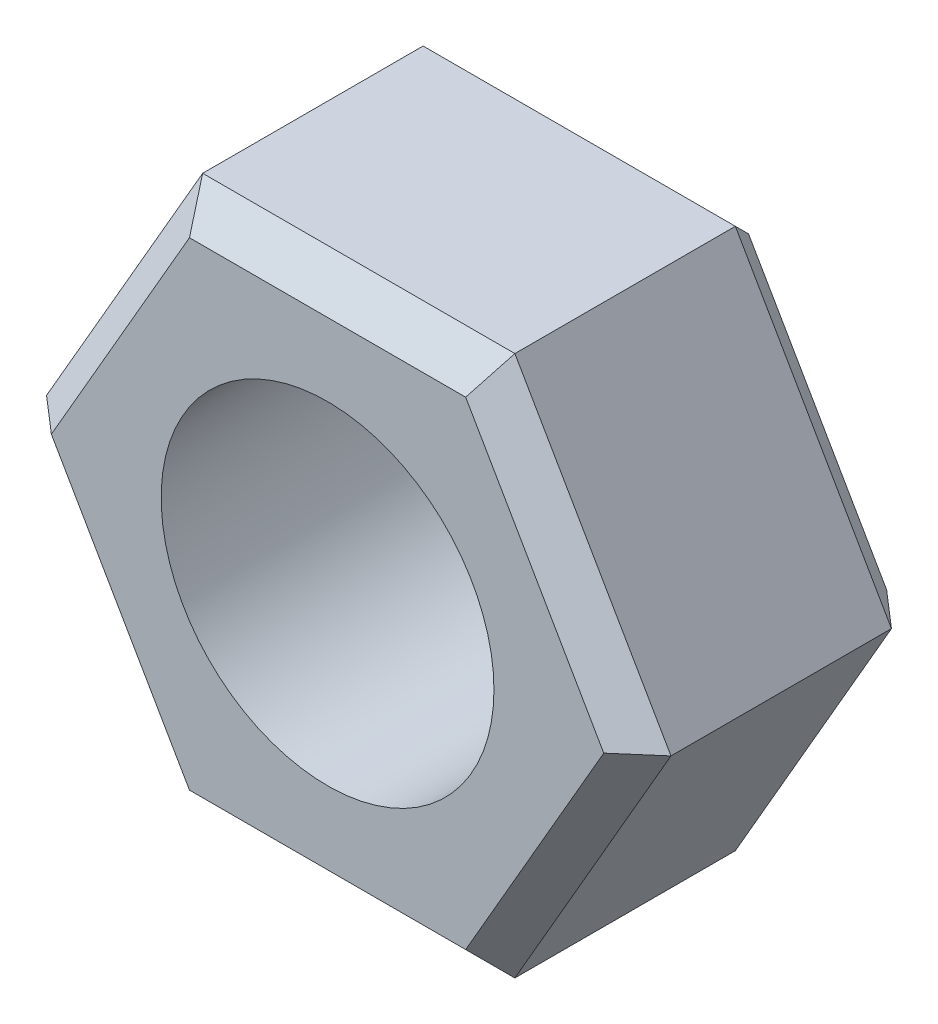
ISO-10303-21;
HEADER;
FILE_DESCRIPTION(('STEP AP214'),'2;1');
FILE_NAME('part.step','',(''),(''),'','','');
FILE_SCHEMA(('AUTOMOTIVE_DESIGN { 1 0 10303 214 1 1 1 1 }'));
ENDSEC;
DATA;
#1=APPLICATION_CONTEXT('core data for automotive mechanical design processes');
#2=APPLICATION_PROTOCOL_DEFINITION('international standard','automotive_design',2000,#1);
#3=PRODUCT_CONTEXT('',#1,'mechanical');
#4=PRODUCT('Part','Part','',(#3));
#5=PRODUCT_RELATED_PRODUCT_CATEGORY('part','',(#4));
#6=PRODUCT_DEFINITION_FORMATION('','',#4);
#7=PRODUCT_DEFINITION_CONTEXT('part definition',#1,'design');
#8=PRODUCT_DEFINITION('design','',#6,#7);
#9=PRODUCT_DEFINITION_SHAPE('','',#8);
#10=(LENGTH_UNIT() NAMED_UNIT(*) SI_UNIT(.MILLI.,.METRE.));
#11=(NAMED_UNIT(*) PLANE_ANGLE_UNIT() SI_UNIT($,.RADIAN.));
#12=(NAMED_UNIT(*) SI_UNIT($,.STERADIAN.) SOLID_ANGLE_UNIT());
#13=UNCERTAINTY_MEASURE_WITH_UNIT(LENGTH_MEASURE(1.E-05),#10,'distance_accuracy_value','');
#14=(GEOMETRIC_REPRESENTATION_CONTEXT(3) GLOBAL_UNCERTAINTY_ASSIGNED_CONTEXT((#13)) GLOBAL_UNIT_ASSIGNED_CONTEXT((#10,
#11,#12)) REPRESENTATION_CONTEXT('',''));
#15=CARTESIAN_POINT('',(0.,0.,0.));
#16=DIRECTION('',(0.,0.,1.));
#17=DIRECTION('',(1.,0.,0.));
#18=AXIS2_PLACEMENT_3D('',#15,#16,#17);
#19=CARTESIAN_POINT('',(0.,0.,6.8));
#20=DIRECTION('',(0.,0.,1.));
#21=DIRECTION('',(1.,0.,0.));
#22=AXIS2_PLACEMENT_3D('',#19,#20,#21);
#23=PLANE('',#22);
#24=DIRECTION('',(-0.5,-0.866025403784439,0.));
#25=VECTOR('',#24,1.);
#26=CARTESIAN_POINT('',(-6.8560344466268,-0.375000000000003,6.8));
#27=LINE('',#26,#25);
#28=CARTESIAN_POINT('',(-3.31976404784035,5.75,6.8));
#29=VERTEX_POINT('',#28);
#30=CARTESIAN_POINT('',(-6.63952809568069,0.,6.8));
#31=VERTEX_POINT('',#30);
#32=EDGE_CURVE('E151',#29,#31,#27,.T.);
#33=ORIENTED_EDGE('',*,*,#32,.T.);
#34=DIRECTION('',(0.5,-0.866025403784439,0.));
#35=VECTOR('',#34,1.);
#36=CARTESIAN_POINT('',(-3.10325769689423,-6.125,6.8));
#37=LINE('',#36,#35);
#38=CARTESIAN_POINT('',(-3.31976404784034,-5.75,6.8));
#39=VERTEX_POINT('',#38);
#40=EDGE_CURVE('E132',#31,#39,#37,.T.);
#41=ORIENTED_EDGE('',*,*,#40,.T.);
#42=DIRECTION('',(1.,0.,0.));
#43=VECTOR('',#42,1.);
#44=CARTESIAN_POINT('',(3.75277674973257,-5.75,6.8));
#45=LINE('',#44,#43);
#46=CARTESIAN_POINT('',(3.31976404784035,-5.75,6.8));
#47=VERTEX_POINT('',#46);
#48=EDGE_CURVE('E140',#39,#47,#45,.T.);
#49=ORIENTED_EDGE('',*,*,#48,.T.);
#50=DIRECTION('',(0.5,0.866025403784439,0.));
#51=VECTOR('',#50,1.);
#52=CARTESIAN_POINT('',(6.8560344466268,0.375000000000004,6.8));
#53=LINE('',#52,#51);
#54=CARTESIAN_POINT('',(6.63952809568069,0.,6.8));
#55=VERTEX_POINT('',#54);
#56=EDGE_CURVE('E146',#47,#55,#53,.T.);
#57=ORIENTED_EDGE('',*,*,#56,.T.);
#58=DIRECTION('',(-0.5,0.866025403784439,0.));
#59=VECTOR('',#58,1.);
#60=CARTESIAN_POINT('',(3.10325769689424,6.125,6.8));
#61=LINE('',#60,#59);
#62=CARTESIAN_POINT('',(3.31976404784035,5.75,6.8));
#63=VERTEX_POINT('',#62);
#64=EDGE_CURVE('E264',#55,#63,#61,.T.);
#65=ORIENTED_EDGE('',*,*,#64,.T.);
#66=DIRECTION('',(-1.,0.,0.));
#67=VECTOR('',#66,1.);
#68=CARTESIAN_POINT('',(-3.75277674973257,5.75,6.8));
#69=LINE('',#68,#67);
#70=EDGE_CURVE('E156',#63,#29,#69,.T.);
#71=ORIENTED_EDGE('',*,*,#70,.T.);
#72=EDGE_LOOP('',(#33,#41,#49,#57,#65,#71));
#73=FACE_BOUND('',#72,.T.);
#74=CARTESIAN_POINT('',(0.,0.,6.8));
#75=DIRECTION('',(0.,0.,1.));
#76=DIRECTION('',(1.,0.,0.));
#77=AXIS2_PLACEMENT_3D('',#74,#75,#76);
#78=CIRCLE('',#77,4.);
#79=CARTESIAN_POINT('',(4.,0.,6.8));
#80=VERTEX_POINT('',#79);
#81=EDGE_CURVE('E246',#80,#80,#78,.T.);
#82=ORIENTED_EDGE('',*,*,#81,.F.);
#83=EDGE_LOOP('',(#82));
#84=FACE_BOUND('',#83,.T.);
#85=ADVANCED_FACE('F37',(#73,#84),#23,.T.);
#86=CARTESIAN_POINT('',(0.,0.,0.));
#87=DIRECTION('',(0.,0.,1.));
#88=DIRECTION('',(1.,0.,0.));
#89=AXIS2_PLACEMENT_3D('',#86,#87,#88);
#90=PLANE('',#89);
#91=DIRECTION('',(-0.5,-0.866025403784439,0.));
#92=VECTOR('',#91,1.);
#93=CARTESIAN_POINT('',(4.97964607176052,-2.875,0.));
#94=LINE('',#93,#92);
#95=CARTESIAN_POINT('',(6.63952809568069,0.,0.));
#96=VERTEX_POINT('',#95);
#97=CARTESIAN_POINT('',(3.31976404784035,-5.75,0.));
#98=VERTEX_POINT('',#97);
#99=EDGE_CURVE('E47',#96,#98,#94,.T.);
#100=ORIENTED_EDGE('',*,*,#99,.T.);
#101=DIRECTION('',(-1.,0.,0.));
#102=VECTOR('',#101,1.);
#103=CARTESIAN_POINT('',(0.,-5.75,0.));
#104=LINE('',#103,#102);
#105=CARTESIAN_POINT('',(-3.31976404784034,-5.75,0.));
#106=VERTEX_POINT('',#105);
#107=EDGE_CURVE('E11',#98,#106,#104,.T.);
#108=ORIENTED_EDGE('',*,*,#107,.T.);
#109=DIRECTION('',(-0.5,0.866025403784439,0.));
#110=VECTOR('',#109,1.);
#111=CARTESIAN_POINT('',(-4.97964607176052,-2.875,0.));
#112=LINE('',#111,#110);
#113=CARTESIAN_POINT('',(-6.63952809568069,0.,0.));
#114=VERTEX_POINT('',#113);
#115=EDGE_CURVE('E182',#106,#114,#112,.T.);
#116=ORIENTED_EDGE('',*,*,#115,.T.);
#117=DIRECTION('',(0.5,0.866025403784439,0.));
#118=VECTOR('',#117,1.);
#119=CARTESIAN_POINT('',(-4.97964607176052,2.875,0.));
#120=LINE('',#119,#118);
#121=CARTESIAN_POINT('',(-3.31976404784035,5.74999999999999,0.));
#122=VERTEX_POINT('',#121);
#123=EDGE_CURVE('E184',#114,#122,#120,.T.);
#124=ORIENTED_EDGE('',*,*,#123,.T.);
#125=DIRECTION('',(1.,0.,0.));
#126=VECTOR('',#125,1.);
#127=CARTESIAN_POINT('',(0.,5.74999999999999,0.));
#128=LINE('',#127,#126);
#129=CARTESIAN_POINT('',(3.31976404784035,5.74999999999999,0.));
#130=VERTEX_POINT('',#129);
#131=EDGE_CURVE('E186',#122,#130,#128,.T.);
#132=ORIENTED_EDGE('',*,*,#131,.T.);
#133=DIRECTION('',(0.5,-0.866025403784439,0.));
#134=VECTOR('',#133,1.);
#135=CARTESIAN_POINT('',(4.97964607176052,2.875,0.));
#136=LINE('',#135,#134);
#137=EDGE_CURVE('E58',#130,#96,#136,.T.);
#138=ORIENTED_EDGE('',*,*,#137,.T.);
#139=EDGE_LOOP('',(#100,#108,#116,#124,#132,#138));
#140=FACE_BOUND('',#139,.T.);
#141=CARTESIAN_POINT('',(0.,0.,0.));
#142=DIRECTION('',(0.,0.,1.));
#143=DIRECTION('',(1.,0.,0.));
#144=AXIS2_PLACEMENT_3D('',#141,#142,#143);
#145=CIRCLE('',#144,4.);
#146=CARTESIAN_POINT('',(4.,0.,0.));
#147=VERTEX_POINT('',#146);
#148=EDGE_CURVE('E201',#147,#147,#145,.T.);
#149=ORIENTED_EDGE('',*,*,#148,.T.);
#150=EDGE_LOOP('',(#149));
#151=FACE_BOUND('',#150,.T.);
#152=ADVANCED_FACE('F226',(#140,#151),#90,.F.);
#153=CARTESIAN_POINT('',(-3.75277674973257,-6.5,6.8));
#154=DIRECTION('',(0.,1.,0.));
#155=DIRECTION('',(-1.,0.,0.));
#156=AXIS2_PLACEMENT_3D('',#153,#154,#155);
#157=PLANE('',#156);
#158=DIRECTION('',(0.,0.,-1.));
#159=VECTOR('',#158,1.);
#160=CARTESIAN_POINT('',(3.75277674973257,-6.5,6.8));
#161=LINE('',#160,#159);
#162=CARTESIAN_POINT('',(3.75277674973257,-6.5,6.05));
#163=VERTEX_POINT('',#162);
#164=CARTESIAN_POINT('',(3.75277674973257,-6.5,0.750000000000002));
#165=VERTEX_POINT('',#164);
#166=EDGE_CURVE('E147',#163,#165,#161,.T.);
#167=ORIENTED_EDGE('',*,*,#166,.F.);
#168=DIRECTION('',(-1.,0.,0.));
#169=VECTOR('',#168,1.);
#170=CARTESIAN_POINT('',(-3.75277674973257,-6.5,6.05));
#171=LINE('',#170,#169);
#172=CARTESIAN_POINT('',(-3.75277674973257,-6.5,6.05));
#173=VERTEX_POINT('',#172);
#174=EDGE_CURVE('E180',#163,#173,#171,.T.);
#175=ORIENTED_EDGE('',*,*,#174,.T.);
#176=DIRECTION('',(0.,0.,-1.));
#177=VECTOR('',#176,1.);
#178=CARTESIAN_POINT('',(-3.75277674973257,-6.5,6.8));
#179=LINE('',#178,#177);
#180=CARTESIAN_POINT('',(-3.75277674973257,-6.5,0.750000000000002));
#181=VERTEX_POINT('',#180);
#182=EDGE_CURVE('E239',#173,#181,#179,.T.);
#183=ORIENTED_EDGE('',*,*,#182,.T.);
#184=DIRECTION('',(1.,0.,0.));
#185=VECTOR('',#184,1.);
#186=CARTESIAN_POINT('',(-3.75277674973257,-6.5,0.750000000000002));
#187=LINE('',#186,#185);
#188=EDGE_CURVE('E177',#181,#165,#187,.T.);
#189=ORIENTED_EDGE('',*,*,#188,.T.);
#190=EDGE_LOOP('',(#167,#175,#183,#189));
#191=FACE_BOUND('',#190,.T.);
#192=ADVANCED_FACE('F244',(#191),#157,.F.);
#193=CARTESIAN_POINT('',(3.75277674973257,-6.5,6.8));
#194=DIRECTION('',(-0.866025403784439,0.5,0.));
#195=DIRECTION('',(-0.5,-0.866025403784439,0.));
#196=AXIS2_PLACEMENT_3D('',#193,#194,#195);
#197=PLANE('',#196);
#198=DIRECTION('',(0.,0.,-1.));
#199=VECTOR('',#198,1.);
#200=CARTESIAN_POINT('',(7.50555349946513,0.,6.8));
#201=LINE('',#200,#199);
#202=CARTESIAN_POINT('',(7.50555349946513,0.,6.05));
#203=VERTEX_POINT('',#202);
#204=CARTESIAN_POINT('',(7.50555349946513,0.,0.750000000000002));
#205=VERTEX_POINT('',#204);
#206=EDGE_CURVE('E259',#203,#205,#201,.T.);
#207=ORIENTED_EDGE('',*,*,#206,.F.);
#208=DIRECTION('',(-0.5,-0.866025403784439,0.));
#209=VECTOR('',#208,1.);
#210=CARTESIAN_POINT('',(3.75277674973257,-6.5,6.05));
#211=LINE('',#210,#209);
#212=EDGE_CURVE('E175',#203,#163,#211,.T.);
#213=ORIENTED_EDGE('',*,*,#212,.T.);
#214=ORIENTED_EDGE('',*,*,#166,.T.);
#215=DIRECTION('',(0.5,0.866025403784439,0.));
#216=VECTOR('',#215,1.);
#217=CARTESIAN_POINT('',(3.75277674973257,-6.5,0.750000000000002));
#218=LINE('',#217,#216);
#219=EDGE_CURVE('E173',#165,#205,#218,.T.);
#220=ORIENTED_EDGE('',*,*,#219,.T.);
#221=EDGE_LOOP('',(#207,#213,#214,#220));
#222=FACE_BOUND('',#221,.T.);
#223=ADVANCED_FACE('F292',(#222),#197,.F.);
#224=CARTESIAN_POINT('',(7.50555349946513,0.,6.8));
#225=DIRECTION('',(-0.866025403784439,-0.5,0.));
#226=DIRECTION('',(0.5,-0.866025403784439,0.));
#227=AXIS2_PLACEMENT_3D('',#224,#225,#226);
#228=PLANE('',#227);
#229=DIRECTION('',(0.,0.,-1.));
#230=VECTOR('',#229,1.);
#231=CARTESIAN_POINT('',(3.75277674973257,6.5,6.8));
#232=LINE('',#231,#230);
#233=CARTESIAN_POINT('',(3.75277674973257,6.5,6.05));
#234=VERTEX_POINT('',#233);
#235=CARTESIAN_POINT('',(3.75277674973257,6.5,0.750000000000002));
#236=VERTEX_POINT('',#235);
#237=EDGE_CURVE('E256',#234,#236,#232,.T.);
#238=ORIENTED_EDGE('',*,*,#237,.F.);
#239=DIRECTION('',(0.5,-0.866025403784439,0.));
#240=VECTOR('',#239,1.);
#241=CARTESIAN_POINT('',(7.50555349946513,0.,6.05));
#242=LINE('',#241,#240);
#243=EDGE_CURVE('E171',#234,#203,#242,.T.);
#244=ORIENTED_EDGE('',*,*,#243,.T.);
#245=ORIENTED_EDGE('',*,*,#206,.T.);
#246=DIRECTION('',(-0.5,0.866025403784439,0.));
#247=VECTOR('',#246,1.);
#248=CARTESIAN_POINT('',(7.50555349946513,0.,0.750000000000002));
#249=LINE('',#248,#247);
#250=EDGE_CURVE('E169',#205,#236,#249,.T.);
#251=ORIENTED_EDGE('',*,*,#250,.T.);
#252=EDGE_LOOP('',(#238,#244,#245,#251));
#253=FACE_BOUND('',#252,.T.);
#254=ADVANCED_FACE('F283',(#253),#228,.F.);
#255=CARTESIAN_POINT('',(3.75277674973257,6.5,6.8));
#256=DIRECTION('',(0.,-1.,0.));
#257=DIRECTION('',(0.,0.,-1.));
#258=AXIS2_PLACEMENT_3D('',#255,#256,#257);
#259=PLANE('',#258);
#260=DIRECTION('',(0.,0.,-1.));
#261=VECTOR('',#260,1.);
#262=CARTESIAN_POINT('',(-3.75277674973257,6.5,6.8));
#263=LINE('',#262,#261);
#264=CARTESIAN_POINT('',(-3.75277674973257,6.5,6.05));
#265=VERTEX_POINT('',#264);
#266=CARTESIAN_POINT('',(-3.75277674973257,6.5,0.750000000000003));
#267=VERTEX_POINT('',#266);
#268=EDGE_CURVE('E248',#265,#267,#263,.T.);
#269=ORIENTED_EDGE('',*,*,#268,.F.);
#270=DIRECTION('',(1.,0.,0.));
#271=VECTOR('',#270,1.);
#272=CARTESIAN_POINT('',(3.75277674973257,6.5,6.05));
#273=LINE('',#272,#271);
#274=EDGE_CURVE('E167',#265,#234,#273,.T.);
#275=ORIENTED_EDGE('',*,*,#274,.T.);
#276=ORIENTED_EDGE('',*,*,#237,.T.);
#277=DIRECTION('',(-1.,0.,0.));
#278=VECTOR('',#277,1.);
#279=CARTESIAN_POINT('',(3.75277674973257,6.5,0.750000000000002));
#280=LINE('',#279,#278);
#281=EDGE_CURVE('E165',#236,#267,#280,.T.);
#282=ORIENTED_EDGE('',*,*,#281,.T.);
#283=EDGE_LOOP('',(#269,#275,#276,#282));
#284=FACE_BOUND('',#283,.T.);
#285=ADVANCED_FACE('F279',(#284),#259,.F.);
#286=CARTESIAN_POINT('',(-3.75277674973257,6.5,6.8));
#287=DIRECTION('',(0.866025403784439,-0.5,0.));
#288=DIRECTION('',(0.5,0.866025403784439,0.));
#289=AXIS2_PLACEMENT_3D('',#286,#287,#288);
#290=PLANE('',#289);
#291=DIRECTION('',(0.,0.,-1.));
#292=VECTOR('',#291,1.);
#293=CARTESIAN_POINT('',(-7.50555349946513,0.,6.8));
#294=LINE('',#293,#292);
#295=CARTESIAN_POINT('',(-7.50555349946513,0.,6.05));
#296=VERTEX_POINT('',#295);
#297=CARTESIAN_POINT('',(-7.50555349946513,0.,0.750000000000002));
#298=VERTEX_POINT('',#297);
#299=EDGE_CURVE('E241',#296,#298,#294,.T.);
#300=ORIENTED_EDGE('',*,*,#299,.F.);
#301=DIRECTION('',(0.5,0.866025403784439,0.));
#302=VECTOR('',#301,1.);
#303=CARTESIAN_POINT('',(-3.75277674973257,6.5,6.05));
#304=LINE('',#303,#302);
#305=EDGE_CURVE('E163',#296,#265,#304,.T.);
#306=ORIENTED_EDGE('',*,*,#305,.T.);
#307=ORIENTED_EDGE('',*,*,#268,.T.);
#308=DIRECTION('',(-0.5,-0.866025403784439,0.));
#309=VECTOR('',#308,1.);
#310=CARTESIAN_POINT('',(-3.75277674973257,6.5,0.750000000000003));
#311=LINE('',#310,#309);
#312=EDGE_CURVE('E161',#267,#298,#311,.T.);
#313=ORIENTED_EDGE('',*,*,#312,.T.);
#314=EDGE_LOOP('',(#300,#306,#307,#313));
#315=FACE_BOUND('',#314,.T.);
#316=ADVANCED_FACE('F277',(#315),#290,.F.);
#317=CARTESIAN_POINT('',(-7.50555349946513,0.,6.8));
#318=DIRECTION('',(0.866025403784439,0.5,0.));
#319=DIRECTION('',(-0.5,0.866025403784439,0.));
#320=AXIS2_PLACEMENT_3D('',#317,#318,#319);
#321=PLANE('',#320);
#322=ORIENTED_EDGE('',*,*,#182,.F.);
#323=DIRECTION('',(-0.5,0.866025403784439,0.));
#324=VECTOR('',#323,1.);
#325=CARTESIAN_POINT('',(-7.50555349946513,0.,6.05));
#326=LINE('',#325,#324);
#327=EDGE_CURVE('E134',#173,#296,#326,.T.);
#328=ORIENTED_EDGE('',*,*,#327,.T.);
#329=ORIENTED_EDGE('',*,*,#299,.T.);
#330=DIRECTION('',(0.5,-0.866025403784439,0.));
#331=VECTOR('',#330,1.);
#332=CARTESIAN_POINT('',(-7.50555349946513,0.,0.750000000000002));
#333=LINE('',#332,#331);
#334=EDGE_CURVE('E153',#298,#181,#333,.T.);
#335=ORIENTED_EDGE('',*,*,#334,.T.);
#336=EDGE_LOOP('',(#322,#328,#329,#335));
#337=FACE_BOUND('',#336,.T.);
#338=ADVANCED_FACE('F238',(#337),#321,.F.);
#339=CARTESIAN_POINT('',(0.,0.,6.8));
#340=DIRECTION('',(0.,0.,-1.));
#341=DIRECTION('',(-1.,0.,0.));
#342=AXIS2_PLACEMENT_3D('',#339,#340,#341);
#343=CYLINDRICAL_SURFACE('',#342,4.);
#344=ORIENTED_EDGE('',*,*,#81,.T.);
#345=EDGE_LOOP('',(#344));
#346=FACE_BOUND('',#345,.T.);
#347=ORIENTED_EDGE('',*,*,#148,.F.);
#348=EDGE_LOOP('',(#347));
#349=FACE_BOUND('',#348,.T.);
#350=ADVANCED_FACE('F316',(#346,#349),#343,.F.);
#351=CARTESIAN_POINT('',(4.97964607176052,2.875,6.8));
#352=DIRECTION('',(0.612372435695795,0.353553390593274,0.707106781186546));
#353=DIRECTION('',(0.5,-0.866025403784439,0.));
#354=AXIS2_PLACEMENT_3D('',#351,#352,#353);
#355=PLANE('',#354);
#356=DIRECTION('',(-0.755928946018454,0.,0.654653670707978));
#357=VECTOR('',#356,1.);
#358=CARTESIAN_POINT('',(5.69102408201203,0.,7.62142857142857));
#359=LINE('',#358,#357);
#360=EDGE_CURVE('E195',#203,#55,#359,.T.);
#361=ORIENTED_EDGE('',*,*,#360,.F.);
#362=ORIENTED_EDGE('',*,*,#243,.F.);
#363=DIRECTION('',(-0.377964473009227,-0.654653670707977,0.654653670707978));
#364=VECTOR('',#363,1.);
#365=CARTESIAN_POINT('',(2.84551204100602,4.92857142857143,7.62142857142857));
#366=LINE('',#365,#364);
#367=EDGE_CURVE('E198',#63,#234,#366,.F.);
#368=ORIENTED_EDGE('',*,*,#367,.F.);
#369=ORIENTED_EDGE('',*,*,#64,.F.);
#370=EDGE_LOOP('',(#361,#362,#368,#369));
#371=FACE_BOUND('',#370,.T.);
#372=ADVANCED_FACE('F287',(#371),#355,.T.);
#373=CARTESIAN_POINT('',(0.,5.75,6.8));
#374=DIRECTION('',(0.,0.707106781186548,0.707106781186547));
#375=DIRECTION('',(1.,0.,0.));
#376=AXIS2_PLACEMENT_3D('',#373,#374,#375);
#377=PLANE('',#376);
#378=ORIENTED_EDGE('',*,*,#367,.T.);
#379=ORIENTED_EDGE('',*,*,#274,.F.);
#380=DIRECTION('',(0.377964473009227,-0.654653670707976,0.654653670707978));
#381=VECTOR('',#380,1.);
#382=CARTESIAN_POINT('',(-2.84551204100601,4.92857142857143,7.62142857142857));
#383=LINE('',#382,#381);
#384=EDGE_CURVE('E192',#29,#265,#383,.F.);
#385=ORIENTED_EDGE('',*,*,#384,.F.);
#386=ORIENTED_EDGE('',*,*,#70,.F.);
#387=EDGE_LOOP('',(#378,#379,#385,#386));
#388=FACE_BOUND('',#387,.T.);
#389=ADVANCED_FACE('F271',(#388),#377,.T.);
#390=CARTESIAN_POINT('',(4.97964607176052,-2.875,6.8));
#391=DIRECTION('',(0.612372435695795,-0.353553390593274,0.707106781186547));
#392=DIRECTION('',(-0.5,-0.866025403784439,0.));
#393=AXIS2_PLACEMENT_3D('',#390,#391,#392);
#394=PLANE('',#393);
#395=ORIENTED_EDGE('',*,*,#360,.T.);
#396=ORIENTED_EDGE('',*,*,#56,.F.);
#397=DIRECTION('',(-0.377964473009227,0.654653670707976,0.654653670707978));
#398=VECTOR('',#397,1.);
#399=CARTESIAN_POINT('',(2.84551204100601,-4.92857142857143,7.62142857142857));
#400=LINE('',#399,#398);
#401=EDGE_CURVE('E143',#163,#47,#400,.T.);
#402=ORIENTED_EDGE('',*,*,#401,.F.);
#403=ORIENTED_EDGE('',*,*,#212,.F.);
#404=EDGE_LOOP('',(#395,#396,#402,#403));
#405=FACE_BOUND('',#404,.T.);
#406=ADVANCED_FACE('F290',(#405),#394,.T.);
#407=CARTESIAN_POINT('',(-4.97964607176052,2.875,6.8));
#408=DIRECTION('',(-0.612372435695795,0.353553390593274,0.707106781186547));
#409=DIRECTION('',(0.5,0.866025403784439,0.));
#410=AXIS2_PLACEMENT_3D('',#407,#408,#409);
#411=PLANE('',#410);
#412=ORIENTED_EDGE('',*,*,#384,.T.);
#413=ORIENTED_EDGE('',*,*,#305,.F.);
#414=DIRECTION('',(0.755928946018454,0.,0.654653670707978));
#415=VECTOR('',#414,1.);
#416=CARTESIAN_POINT('',(-5.69102408201202,0.,7.62142857142857));
#417=LINE('',#416,#415);
#418=EDGE_CURVE('E137',#31,#296,#417,.F.);
#419=ORIENTED_EDGE('',*,*,#418,.F.);
#420=ORIENTED_EDGE('',*,*,#32,.F.);
#421=EDGE_LOOP('',(#412,#413,#419,#420));
#422=FACE_BOUND('',#421,.T.);
#423=ADVANCED_FACE('F274',(#422),#411,.T.);
#424=CARTESIAN_POINT('',(0.,-5.75,6.8));
#425=DIRECTION('',(0.,-0.707106781186549,0.707106781186546));
#426=DIRECTION('',(-1.,0.,0.));
#427=AXIS2_PLACEMENT_3D('',#424,#425,#426);
#428=PLANE('',#427);
#429=ORIENTED_EDGE('',*,*,#401,.T.);
#430=ORIENTED_EDGE('',*,*,#48,.F.);
#431=DIRECTION('',(-0.377964473009227,-0.654653670707976,-0.654653670707978));
#432=VECTOR('',#431,1.);
#433=CARTESIAN_POINT('',(-2.84551204100601,-4.92857142857143,7.62142857142857));
#434=LINE('',#433,#432);
#435=EDGE_CURVE('E128',#173,#39,#434,.F.);
#436=ORIENTED_EDGE('',*,*,#435,.F.);
#437=ORIENTED_EDGE('',*,*,#174,.F.);
#438=EDGE_LOOP('',(#429,#430,#436,#437));
#439=FACE_BOUND('',#438,.T.);
#440=ADVANCED_FACE('F141',(#439),#428,.T.);
#441=CARTESIAN_POINT('',(-4.97964607176052,-2.875,6.8));
#442=DIRECTION('',(-0.612372435695795,-0.353553390593274,0.707106781186547));
#443=DIRECTION('',(-0.5,0.866025403784439,0.));
#444=AXIS2_PLACEMENT_3D('',#441,#442,#443);
#445=PLANE('',#444);
#446=ORIENTED_EDGE('',*,*,#418,.T.);
#447=ORIENTED_EDGE('',*,*,#327,.F.);
#448=ORIENTED_EDGE('',*,*,#435,.T.);
#449=ORIENTED_EDGE('',*,*,#40,.F.);
#450=EDGE_LOOP('',(#446,#447,#448,#449));
#451=FACE_BOUND('',#450,.T.);
#452=ADVANCED_FACE('F130',(#451),#445,.T.);
#453=CARTESIAN_POINT('',(3.75277674973257,6.5,0.750000000000002));
#454=DIRECTION('',(0.,-0.707106781186547,0.707106781186548));
#455=DIRECTION('',(-1.,0.,0.));
#456=AXIS2_PLACEMENT_3D('',#453,#454,#455);
#457=PLANE('',#456);
#458=DIRECTION('',(-0.377964473009227,-0.654653670707978,-0.654653670707977));
#459=VECTOR('',#458,1.);
#460=CARTESIAN_POINT('',(3.75277674973257,6.5,0.750000000000002));
#461=LINE('',#460,#459);
#462=EDGE_CURVE('E211',#130,#236,#461,.F.);
#463=ORIENTED_EDGE('',*,*,#462,.F.);
#464=ORIENTED_EDGE('',*,*,#131,.F.);
#465=DIRECTION('',(0.377964473009227,-0.654653670707978,-0.654653670707977));
#466=VECTOR('',#465,1.);
#467=CARTESIAN_POINT('',(-3.75277674973257,6.5,0.750000000000002));
#468=LINE('',#467,#466);
#469=EDGE_CURVE('E42',#267,#122,#468,.T.);
#470=ORIENTED_EDGE('',*,*,#469,.F.);
#471=ORIENTED_EDGE('',*,*,#281,.F.);
#472=EDGE_LOOP('',(#463,#464,#470,#471));
#473=FACE_BOUND('',#472,.T.);
#474=ADVANCED_FACE('F40',(#473),#457,.F.);
#475=CARTESIAN_POINT('',(-3.75277674973257,6.5,0.750000000000002));
#476=DIRECTION('',(0.612372435695794,-0.353553390593274,0.707106781186548));
#477=DIRECTION('',(-0.5,-0.866025403784439,0.));
#478=AXIS2_PLACEMENT_3D('',#475,#476,#477);
#479=PLANE('',#478);
#480=ORIENTED_EDGE('',*,*,#469,.T.);
#481=ORIENTED_EDGE('',*,*,#123,.F.);
#482=DIRECTION('',(0.755928946018455,0.,-0.654653670707977));
#483=VECTOR('',#482,1.);
#484=CARTESIAN_POINT('',(-7.50555349946513,0.,0.750000000000002));
#485=LINE('',#484,#483);
#486=EDGE_CURVE('E209',#298,#114,#485,.T.);
#487=ORIENTED_EDGE('',*,*,#486,.F.);
#488=ORIENTED_EDGE('',*,*,#312,.F.);
#489=EDGE_LOOP('',(#480,#481,#487,#488));
#490=FACE_BOUND('',#489,.T.);
#491=ADVANCED_FACE('F221',(#490),#479,.F.);
#492=CARTESIAN_POINT('',(7.50555349946513,0.,0.750000000000002));
#493=DIRECTION('',(-0.612372435695794,-0.353553390593273,0.707106781186548));
#494=DIRECTION('',(-0.5,0.866025403784439,0.));
#495=AXIS2_PLACEMENT_3D('',#492,#493,#494);
#496=PLANE('',#495);
#497=ORIENTED_EDGE('',*,*,#462,.T.);
#498=ORIENTED_EDGE('',*,*,#250,.F.);
#499=DIRECTION('',(-0.755928946018455,0.,-0.654653670707977));
#500=VECTOR('',#499,1.);
#501=CARTESIAN_POINT('',(7.50555349946513,0.,0.750000000000002));
#502=LINE('',#501,#500);
#503=EDGE_CURVE('E206',#96,#205,#502,.F.);
#504=ORIENTED_EDGE('',*,*,#503,.F.);
#505=ORIENTED_EDGE('',*,*,#137,.F.);
#506=EDGE_LOOP('',(#497,#498,#504,#505));
#507=FACE_BOUND('',#506,.T.);
#508=ADVANCED_FACE('F294',(#507),#496,.F.);
#509=CARTESIAN_POINT('',(-7.50555349946513,0.,0.750000000000002));
#510=DIRECTION('',(0.612372435695794,0.353553390593274,0.707106781186548));
#511=DIRECTION('',(0.5,-0.866025403784439,0.));
#512=AXIS2_PLACEMENT_3D('',#509,#510,#511);
#513=PLANE('',#512);
#514=ORIENTED_EDGE('',*,*,#486,.T.);
#515=ORIENTED_EDGE('',*,*,#115,.F.);
#516=DIRECTION('',(-0.377964473009226,-0.654653670707978,0.654653670707977));
#517=VECTOR('',#516,1.);
#518=CARTESIAN_POINT('',(-2.68055482123755,-4.64285714285714,-1.10714285714286));
#519=LINE('',#518,#517);
#520=EDGE_CURVE('E204',#181,#106,#519,.F.);
#521=ORIENTED_EDGE('',*,*,#520,.F.);
#522=ORIENTED_EDGE('',*,*,#334,.F.);
#523=EDGE_LOOP('',(#514,#515,#521,#522));
#524=FACE_BOUND('',#523,.T.);
#525=ADVANCED_FACE('F231',(#524),#513,.F.);
#526=CARTESIAN_POINT('',(3.75277674973257,-6.5,0.750000000000002));
#527=DIRECTION('',(-0.612372435695794,0.353553390593273,0.707106781186548));
#528=DIRECTION('',(0.5,0.866025403784439,0.));
#529=AXIS2_PLACEMENT_3D('',#526,#527,#528);
#530=PLANE('',#529);
#531=ORIENTED_EDGE('',*,*,#503,.T.);
#532=ORIENTED_EDGE('',*,*,#219,.F.);
#533=DIRECTION('',(-0.377964473009227,0.654653670707978,-0.654653670707977));
#534=VECTOR('',#533,1.);
#535=CARTESIAN_POINT('',(3.75277674973257,-6.5,0.750000000000002));
#536=LINE('',#535,#534);
#537=EDGE_CURVE('E202',#98,#165,#536,.F.);
#538=ORIENTED_EDGE('',*,*,#537,.F.);
#539=ORIENTED_EDGE('',*,*,#99,.F.);
#540=EDGE_LOOP('',(#531,#532,#538,#539));
#541=FACE_BOUND('',#540,.T.);
#542=ADVANCED_FACE('F296',(#541),#530,.F.);
#543=CARTESIAN_POINT('',(-3.75277674973257,-6.5,0.750000000000002));
#544=DIRECTION('',(0.,0.707106781186547,0.707106781186548));
#545=DIRECTION('',(1.,0.,0.));
#546=AXIS2_PLACEMENT_3D('',#543,#544,#545);
#547=PLANE('',#546);
#548=ORIENTED_EDGE('',*,*,#520,.T.);
#549=ORIENTED_EDGE('',*,*,#107,.F.);
#550=ORIENTED_EDGE('',*,*,#537,.T.);
#551=ORIENTED_EDGE('',*,*,#188,.F.);
#552=EDGE_LOOP('',(#548,#549,#550,#551));
#553=FACE_BOUND('',#552,.T.);
#554=ADVANCED_FACE('F299',(#553),#547,.F.);
#555=CLOSED_SHELL('',(#85,#152,#192,#223,#254,#285,#316,#338,#350,#372,#389,#406,#423,#440,#452,
#474,#491,#508,#525,#542,#554));
#556=MANIFOLD_SOLID_BREP('B2',#555);
#557=ADVANCED_BREP_SHAPE_REPRESENTATION('',(#18,#556),#14);
#558=SHAPE_DEFINITION_REPRESENTATION(#9,#557);
ENDSEC;
END-ISO-10303-21;
